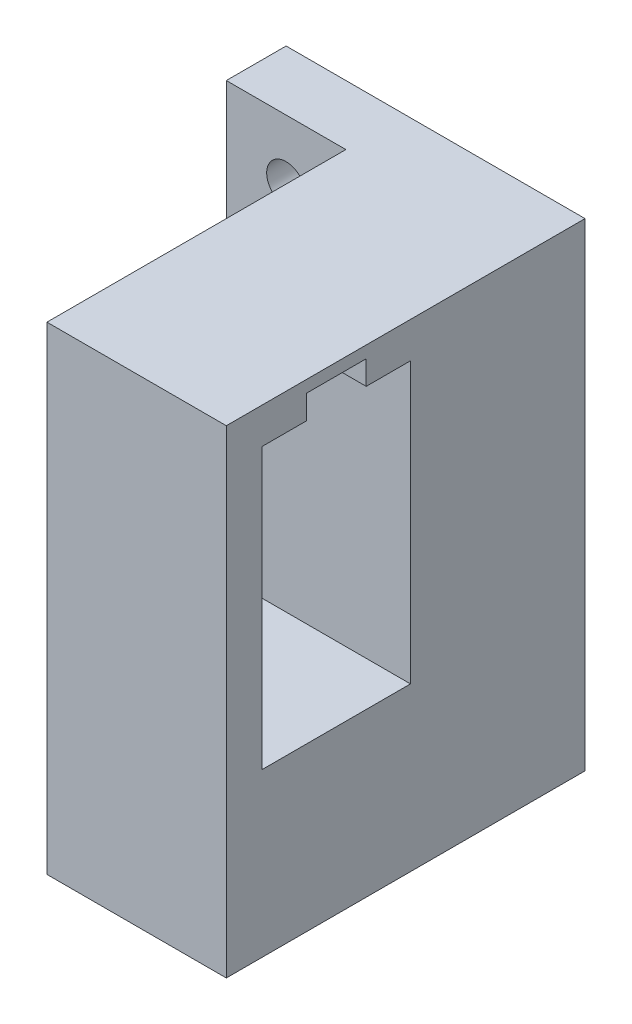
ISO-10303-21;
HEADER;
FILE_DESCRIPTION(('STEP AP214'),'2;1');
FILE_NAME('part.step','',(''),(''),'','','');
FILE_SCHEMA(('AUTOMOTIVE_DESIGN { 1 0 10303 214 1 1 1 1 }'));
ENDSEC;
DATA;
#1=APPLICATION_CONTEXT('core data for automotive mechanical design processes');
#2=APPLICATION_PROTOCOL_DEFINITION('international standard','automotive_design',2000,#1);
#3=PRODUCT_CONTEXT('',#1,'mechanical');
#4=PRODUCT('Part','Part','',(#3));
#5=PRODUCT_RELATED_PRODUCT_CATEGORY('part','',(#4));
#6=PRODUCT_DEFINITION_FORMATION('','',#4);
#7=PRODUCT_DEFINITION_CONTEXT('part definition',#1,'design');
#8=PRODUCT_DEFINITION('design','',#6,#7);
#9=PRODUCT_DEFINITION_SHAPE('','',#8);
#10=(LENGTH_UNIT() NAMED_UNIT(*) SI_UNIT(.MILLI.,.METRE.));
#11=(NAMED_UNIT(*) PLANE_ANGLE_UNIT() SI_UNIT($,.RADIAN.));
#12=(NAMED_UNIT(*) SI_UNIT($,.STERADIAN.) SOLID_ANGLE_UNIT());
#13=UNCERTAINTY_MEASURE_WITH_UNIT(LENGTH_MEASURE(1.E-05),#10,'distance_accuracy_value','');
#14=(GEOMETRIC_REPRESENTATION_CONTEXT(3) GLOBAL_UNCERTAINTY_ASSIGNED_CONTEXT((#13)) GLOBAL_UNIT_ASSIGNED_CONTEXT((#10,
#11,#12)) REPRESENTATION_CONTEXT('',''));
#15=CARTESIAN_POINT('',(0.,0.,0.));
#16=DIRECTION('',(0.,0.,1.));
#17=DIRECTION('',(1.,0.,0.));
#18=AXIS2_PLACEMENT_3D('',#15,#16,#17);
#19=CARTESIAN_POINT('',(11.,-3.,0.));
#20=DIRECTION('',(0.,1.,0.));
#21=DIRECTION('',(0.,0.,1.));
#22=AXIS2_PLACEMENT_3D('',#19,#20,#21);
#23=PLANE('',#22);
#24=DIRECTION('',(0.,0.,1.));
#25=VECTOR('',#24,1.);
#26=CARTESIAN_POINT('',(11.,-3.,0.));
#27=LINE('',#26,#25);
#28=CARTESIAN_POINT('',(11.,-3.,23.3));
#29=VERTEX_POINT('',#28);
#30=CARTESIAN_POINT('',(11.,-3.,27.));
#31=VERTEX_POINT('',#30);
#32=EDGE_CURVE('E192',#29,#31,#27,.T.);
#33=ORIENTED_EDGE('',*,*,#32,.F.);
#34=DIRECTION('',(1.,0.,0.));
#35=VECTOR('',#34,1.);
#36=CARTESIAN_POINT('',(11.,-3.,23.3));
#37=LINE('',#36,#35);
#38=CARTESIAN_POINT('',(25.,-3.,23.3));
#39=VERTEX_POINT('',#38);
#40=EDGE_CURVE('E181',#29,#39,#37,.T.);
#41=ORIENTED_EDGE('',*,*,#40,.T.);
#42=DIRECTION('',(0.,0.,1.));
#43=VECTOR('',#42,1.);
#44=CARTESIAN_POINT('',(25.,-3.,0.));
#45=LINE('',#44,#43);
#46=CARTESIAN_POINT('',(25.,-3.,27.));
#47=VERTEX_POINT('',#46);
#48=EDGE_CURVE('E187',#39,#47,#45,.T.);
#49=ORIENTED_EDGE('',*,*,#48,.T.);
#50=DIRECTION('',(1.,0.,0.));
#51=VECTOR('',#50,1.);
#52=CARTESIAN_POINT('',(11.,-3.,27.));
#53=LINE('',#52,#51);
#54=EDGE_CURVE('E199',#31,#47,#53,.T.);
#55=ORIENTED_EDGE('',*,*,#54,.F.);
#56=EDGE_LOOP('',(#33,#41,#49,#55));
#57=FACE_BOUND('',#56,.T.);
#58=ADVANCED_FACE('F33',(#57),#23,.F.);
#59=CARTESIAN_POINT('',(0.,0.,5.));
#60=DIRECTION('',(1.,0.,0.));
#61=DIRECTION('',(0.,1.,0.));
#62=AXIS2_PLACEMENT_3D('',#59,#60,#61);
#63=PLANE('',#62);
#64=DIRECTION('',(0.,-1.,0.));
#65=VECTOR('',#64,1.);
#66=CARTESIAN_POINT('',(0.,0.,0.));
#67=LINE('',#66,#65);
#68=CARTESIAN_POINT('',(0.,0.,0.));
#69=VERTEX_POINT('',#68);
#70=CARTESIAN_POINT('',(0.,-40.,0.));
#71=VERTEX_POINT('',#70);
#72=EDGE_CURVE('E242',#69,#71,#67,.T.);
#73=ORIENTED_EDGE('',*,*,#72,.T.);
#74=DIRECTION('',(0.,0.,-1.));
#75=VECTOR('',#74,1.);
#76=CARTESIAN_POINT('',(0.,-40.,5.));
#77=LINE('',#76,#75);
#78=CARTESIAN_POINT('',(0.,-40.,5.));
#79=VERTEX_POINT('',#78);
#80=EDGE_CURVE('E275',#79,#71,#77,.T.);
#81=ORIENTED_EDGE('',*,*,#80,.F.);
#82=DIRECTION('',(0.,-1.,0.));
#83=VECTOR('',#82,1.);
#84=CARTESIAN_POINT('',(0.,0.,5.));
#85=LINE('',#84,#83);
#86=CARTESIAN_POINT('',(0.,0.,5.));
#87=VERTEX_POINT('',#86);
#88=EDGE_CURVE('E251',#87,#79,#85,.T.);
#89=ORIENTED_EDGE('',*,*,#88,.F.);
#90=DIRECTION('',(0.,0.,-1.));
#91=VECTOR('',#90,1.);
#92=CARTESIAN_POINT('',(0.,0.,5.));
#93=LINE('',#92,#91);
#94=EDGE_CURVE('E259',#87,#69,#93,.T.);
#95=ORIENTED_EDGE('',*,*,#94,.T.);
#96=EDGE_LOOP('',(#73,#81,#89,#95));
#97=FACE_BOUND('',#96,.T.);
#98=ADVANCED_FACE('F35',(#97),#63,.F.);
#99=CARTESIAN_POINT('',(0.,-40.,5.));
#100=DIRECTION('',(0.,1.,0.));
#101=DIRECTION('',(0.,0.,1.));
#102=AXIS2_PLACEMENT_3D('',#99,#100,#101);
#103=PLANE('',#102);
#104=DIRECTION('',(1.,0.,0.));
#105=VECTOR('',#104,1.);
#106=CARTESIAN_POINT('',(0.,-40.,0.));
#107=LINE('',#106,#105);
#108=CARTESIAN_POINT('',(25.,-40.,0.));
#109=VERTEX_POINT('',#108);
#110=EDGE_CURVE('E262',#71,#109,#107,.T.);
#111=ORIENTED_EDGE('',*,*,#110,.T.);
#112=DIRECTION('',(0.,0.,-1.));
#113=VECTOR('',#112,1.);
#114=CARTESIAN_POINT('',(25.,-40.,5.));
#115=LINE('',#114,#113);
#116=CARTESIAN_POINT('',(25.,-40.,30.));
#117=VERTEX_POINT('',#116);
#118=EDGE_CURVE('E272',#117,#109,#115,.T.);
#119=ORIENTED_EDGE('',*,*,#118,.F.);
#120=DIRECTION('',(1.,0.,0.));
#121=VECTOR('',#120,1.);
#122=CARTESIAN_POINT('',(25.,-40.,30.));
#123=LINE('',#122,#121);
#124=CARTESIAN_POINT('',(10.,-40.,30.));
#125=VERTEX_POINT('',#124);
#126=EDGE_CURVE('E227',#125,#117,#123,.T.);
#127=ORIENTED_EDGE('',*,*,#126,.F.);
#128=DIRECTION('',(0.,0.,-1.));
#129=VECTOR('',#128,1.);
#130=CARTESIAN_POINT('',(10.,-40.,30.));
#131=LINE('',#130,#129);
#132=CARTESIAN_POINT('',(10.,-40.,5.));
#133=VERTEX_POINT('',#132);
#134=EDGE_CURVE('E230',#125,#133,#131,.T.);
#135=ORIENTED_EDGE('',*,*,#134,.T.);
#136=DIRECTION('',(1.,0.,0.));
#137=VECTOR('',#136,1.);
#138=CARTESIAN_POINT('',(0.,-40.,5.));
#139=LINE('',#138,#137);
#140=EDGE_CURVE('E254',#79,#133,#139,.T.);
#141=ORIENTED_EDGE('',*,*,#140,.F.);
#142=ORIENTED_EDGE('',*,*,#80,.T.);
#143=EDGE_LOOP('',(#111,#119,#127,#135,#141,#142));
#144=FACE_BOUND('',#143,.T.);
#145=ADVANCED_FACE('F327',(#144),#103,.F.);
#146=CARTESIAN_POINT('',(25.,0.,5.));
#147=DIRECTION('',(-1.,0.,0.));
#148=DIRECTION('',(0.,-1.,0.));
#149=AXIS2_PLACEMENT_3D('',#146,#147,#148);
#150=PLANE('',#149);
#151=ORIENTED_EDGE('',*,*,#48,.F.);
#152=DIRECTION('',(0.,-1.,0.));
#153=VECTOR('',#152,1.);
#154=CARTESIAN_POINT('',(25.,-1.,23.3));
#155=LINE('',#154,#153);
#156=CARTESIAN_POINT('',(25.,-1.,23.3));
#157=VERTEX_POINT('',#156);
#158=EDGE_CURVE('E164',#157,#39,#155,.T.);
#159=ORIENTED_EDGE('',*,*,#158,.F.);
#160=DIRECTION('',(0.,0.,1.));
#161=VECTOR('',#160,1.);
#162=CARTESIAN_POINT('',(25.,-1.,23.3));
#163=LINE('',#162,#161);
#164=CARTESIAN_POINT('',(25.,-1.,18.3));
#165=VERTEX_POINT('',#164);
#166=EDGE_CURVE('E150',#165,#157,#163,.T.);
#167=ORIENTED_EDGE('',*,*,#166,.F.);
#168=DIRECTION('',(0.,1.,0.));
#169=VECTOR('',#168,1.);
#170=CARTESIAN_POINT('',(25.,-1.,18.3));
#171=LINE('',#170,#169);
#172=CARTESIAN_POINT('',(25.,-3.,18.3));
#173=VERTEX_POINT('',#172);
#174=EDGE_CURVE('E157',#173,#165,#171,.T.);
#175=ORIENTED_EDGE('',*,*,#174,.F.);
#176=CARTESIAN_POINT('',(25.,-3.,14.6));
#177=VERTEX_POINT('',#176);
#178=EDGE_CURVE('E200',#177,#173,#45,.T.);
#179=ORIENTED_EDGE('',*,*,#178,.F.);
#180=DIRECTION('',(0.,-1.,0.));
#181=VECTOR('',#180,1.);
#182=CARTESIAN_POINT('',(25.,0.,14.6));
#183=LINE('',#182,#181);
#184=CARTESIAN_POINT('',(25.,-26.4,14.6));
#185=VERTEX_POINT('',#184);
#186=EDGE_CURVE('E208',#177,#185,#183,.T.);
#187=ORIENTED_EDGE('',*,*,#186,.T.);
#188=DIRECTION('',(0.,0.,1.));
#189=VECTOR('',#188,1.);
#190=CARTESIAN_POINT('',(25.,-26.4,0.));
#191=LINE('',#190,#189);
#192=CARTESIAN_POINT('',(25.,-26.4,27.));
#193=VERTEX_POINT('',#192);
#194=EDGE_CURVE('E205',#185,#193,#191,.T.);
#195=ORIENTED_EDGE('',*,*,#194,.T.);
#196=DIRECTION('',(0.,-1.,0.));
#197=VECTOR('',#196,1.);
#198=CARTESIAN_POINT('',(25.,0.,27.));
#199=LINE('',#198,#197);
#200=EDGE_CURVE('E202',#47,#193,#199,.T.);
#201=ORIENTED_EDGE('',*,*,#200,.F.);
#202=EDGE_LOOP('',(#151,#159,#167,#175,#179,#187,#195,#201));
#203=FACE_BOUND('',#202,.T.);
#204=DIRECTION('',(0.,1.,0.));
#205=VECTOR('',#204,1.);
#206=CARTESIAN_POINT('',(25.,0.,0.));
#207=LINE('',#206,#205);
#208=CARTESIAN_POINT('',(25.,0.,0.));
#209=VERTEX_POINT('',#208);
#210=EDGE_CURVE('E264',#109,#209,#207,.T.);
#211=ORIENTED_EDGE('',*,*,#210,.T.);
#212=DIRECTION('',(0.,0.,-1.));
#213=VECTOR('',#212,1.);
#214=CARTESIAN_POINT('',(25.,0.,5.));
#215=LINE('',#214,#213);
#216=CARTESIAN_POINT('',(25.,0.,30.));
#217=VERTEX_POINT('',#216);
#218=EDGE_CURVE('E269',#217,#209,#215,.T.);
#219=ORIENTED_EDGE('',*,*,#218,.F.);
#220=DIRECTION('',(0.,1.,0.));
#221=VECTOR('',#220,1.);
#222=CARTESIAN_POINT('',(25.,0.,30.));
#223=LINE('',#222,#221);
#224=EDGE_CURVE('E220',#117,#217,#223,.T.);
#225=ORIENTED_EDGE('',*,*,#224,.F.);
#226=ORIENTED_EDGE('',*,*,#118,.T.);
#227=EDGE_LOOP('',(#211,#219,#225,#226));
#228=FACE_BOUND('',#227,.T.);
#229=ADVANCED_FACE('F167',(#203,#228),#150,.F.);
#230=CARTESIAN_POINT('',(0.,0.,5.));
#231=DIRECTION('',(0.,-1.,0.));
#232=DIRECTION('',(0.,0.,-1.));
#233=AXIS2_PLACEMENT_3D('',#230,#231,#232);
#234=PLANE('',#233);
#235=DIRECTION('',(-1.,0.,0.));
#236=VECTOR('',#235,1.);
#237=CARTESIAN_POINT('',(0.,0.,0.));
#238=LINE('',#237,#236);
#239=EDGE_CURVE('E255',#209,#69,#238,.T.);
#240=ORIENTED_EDGE('',*,*,#239,.T.);
#241=ORIENTED_EDGE('',*,*,#94,.F.);
#242=DIRECTION('',(-1.,0.,0.));
#243=VECTOR('',#242,1.);
#244=CARTESIAN_POINT('',(0.,0.,5.));
#245=LINE('',#244,#243);
#246=CARTESIAN_POINT('',(10.,0.,5.));
#247=VERTEX_POINT('',#246);
#248=EDGE_CURVE('E257',#247,#87,#245,.T.);
#249=ORIENTED_EDGE('',*,*,#248,.F.);
#250=DIRECTION('',(0.,0.,-1.));
#251=VECTOR('',#250,1.);
#252=CARTESIAN_POINT('',(10.,0.,30.));
#253=LINE('',#252,#251);
#254=CARTESIAN_POINT('',(10.,0.,30.));
#255=VERTEX_POINT('',#254);
#256=EDGE_CURVE('E235',#255,#247,#253,.T.);
#257=ORIENTED_EDGE('',*,*,#256,.F.);
#258=DIRECTION('',(-1.,0.,0.));
#259=VECTOR('',#258,1.);
#260=CARTESIAN_POINT('',(25.,0.,30.));
#261=LINE('',#260,#259);
#262=EDGE_CURVE('E223',#217,#255,#261,.T.);
#263=ORIENTED_EDGE('',*,*,#262,.F.);
#264=ORIENTED_EDGE('',*,*,#218,.T.);
#265=EDGE_LOOP('',(#240,#241,#249,#257,#263,#264));
#266=FACE_BOUND('',#265,.T.);
#267=ADVANCED_FACE('F349',(#266),#234,.F.);
#268=CARTESIAN_POINT('',(0.,0.,5.));
#269=DIRECTION('',(0.,0.,1.));
#270=DIRECTION('',(1.,0.,0.));
#271=AXIS2_PLACEMENT_3D('',#268,#269,#270);
#272=PLANE('',#271);
#273=DIRECTION('',(0.,-1.,0.));
#274=VECTOR('',#273,1.);
#275=CARTESIAN_POINT('',(10.,0.,5.));
#276=LINE('',#275,#274);
#277=EDGE_CURVE('E213',#247,#133,#276,.T.);
#278=ORIENTED_EDGE('',*,*,#277,.F.);
#279=ORIENTED_EDGE('',*,*,#248,.T.);
#280=ORIENTED_EDGE('',*,*,#88,.T.);
#281=ORIENTED_EDGE('',*,*,#140,.T.);
#282=EDGE_LOOP('',(#278,#279,#280,#281));
#283=FACE_BOUND('',#282,.T.);
#284=CARTESIAN_POINT('',(5.,-5.,5.));
#285=DIRECTION('',(0.,0.,1.));
#286=DIRECTION('',(1.,0.,0.));
#287=AXIS2_PLACEMENT_3D('',#284,#285,#286);
#288=CIRCLE('',#287,1.625);
#289=CARTESIAN_POINT('',(6.625,-5.,5.));
#290=VERTEX_POINT('',#289);
#291=EDGE_CURVE('E243',#290,#290,#288,.T.);
#292=ORIENTED_EDGE('',*,*,#291,.F.);
#293=EDGE_LOOP('',(#292));
#294=FACE_BOUND('',#293,.T.);
#295=CARTESIAN_POINT('',(4.99999999999999,-35.,5.));
#296=DIRECTION('',(0.,0.,1.));
#297=DIRECTION('',(1.,0.,0.));
#298=AXIS2_PLACEMENT_3D('',#295,#296,#297);
#299=CIRCLE('',#298,1.625);
#300=CARTESIAN_POINT('',(6.625,-35.,5.));
#301=VERTEX_POINT('',#300);
#302=EDGE_CURVE('E238',#301,#301,#299,.T.);
#303=ORIENTED_EDGE('',*,*,#302,.F.);
#304=EDGE_LOOP('',(#303));
#305=FACE_BOUND('',#304,.T.);
#306=ADVANCED_FACE('F344',(#283,#294,#305),#272,.T.);
#307=CARTESIAN_POINT('',(0.,0.,0.));
#308=DIRECTION('',(0.,0.,1.));
#309=DIRECTION('',(1.,0.,0.));
#310=AXIS2_PLACEMENT_3D('',#307,#308,#309);
#311=PLANE('',#310);
#312=CARTESIAN_POINT('',(5.,-5.,0.));
#313=DIRECTION('',(0.,0.,1.));
#314=DIRECTION('',(1.,0.,0.));
#315=AXIS2_PLACEMENT_3D('',#312,#313,#314);
#316=CIRCLE('',#315,1.625);
#317=CARTESIAN_POINT('',(6.625,-5.,0.));
#318=VERTEX_POINT('',#317);
#319=EDGE_CURVE('E239',#318,#318,#316,.T.);
#320=ORIENTED_EDGE('',*,*,#319,.T.);
#321=EDGE_LOOP('',(#320));
#322=FACE_BOUND('',#321,.T.);
#323=CARTESIAN_POINT('',(4.99999999999999,-35.,0.));
#324=DIRECTION('',(0.,0.,1.));
#325=DIRECTION('',(1.,0.,0.));
#326=AXIS2_PLACEMENT_3D('',#323,#324,#325);
#327=CIRCLE('',#326,1.625);
#328=CARTESIAN_POINT('',(6.625,-35.,0.));
#329=VERTEX_POINT('',#328);
#330=EDGE_CURVE('E246',#329,#329,#327,.T.);
#331=ORIENTED_EDGE('',*,*,#330,.T.);
#332=EDGE_LOOP('',(#331));
#333=FACE_BOUND('',#332,.T.);
#334=ORIENTED_EDGE('',*,*,#72,.F.);
#335=ORIENTED_EDGE('',*,*,#239,.F.);
#336=ORIENTED_EDGE('',*,*,#210,.F.);
#337=ORIENTED_EDGE('',*,*,#110,.F.);
#338=EDGE_LOOP('',(#334,#335,#336,#337));
#339=FACE_BOUND('',#338,.T.);
#340=ADVANCED_FACE('F339',(#322,#333,#339),#311,.F.);
#341=CARTESIAN_POINT('',(4.99999999999999,-35.,0.));
#342=DIRECTION('',(0.,0.,1.));
#343=DIRECTION('',(1.,0.,0.));
#344=AXIS2_PLACEMENT_3D('',#341,#342,#343);
#345=CYLINDRICAL_SURFACE('',#344,1.625);
#346=ORIENTED_EDGE('',*,*,#330,.F.);
#347=EDGE_LOOP('',(#346));
#348=FACE_BOUND('',#347,.T.);
#349=ORIENTED_EDGE('',*,*,#302,.T.);
#350=EDGE_LOOP('',(#349));
#351=FACE_BOUND('',#350,.T.);
#352=ADVANCED_FACE('F359',(#348,#351),#345,.F.);
#353=CARTESIAN_POINT('',(5.,-5.,0.));
#354=DIRECTION('',(0.,0.,1.));
#355=DIRECTION('',(1.,0.,0.));
#356=AXIS2_PLACEMENT_3D('',#353,#354,#355);
#357=CYLINDRICAL_SURFACE('',#356,1.625);
#358=ORIENTED_EDGE('',*,*,#319,.F.);
#359=EDGE_LOOP('',(#358));
#360=FACE_BOUND('',#359,.T.);
#361=ORIENTED_EDGE('',*,*,#291,.T.);
#362=EDGE_LOOP('',(#361));
#363=FACE_BOUND('',#362,.T.);
#364=ADVANCED_FACE('F354',(#360,#363),#357,.F.);
#365=CARTESIAN_POINT('',(10.,0.,30.));
#366=DIRECTION('',(1.,0.,0.));
#367=DIRECTION('',(0.,1.,0.));
#368=AXIS2_PLACEMENT_3D('',#365,#366,#367);
#369=PLANE('',#368);
#370=DIRECTION('',(0.,0.,1.));
#371=VECTOR('',#370,1.);
#372=CARTESIAN_POINT('',(10.,-1.,30.));
#373=LINE('',#372,#371);
#374=CARTESIAN_POINT('',(10.,-1.,18.3));
#375=VERTEX_POINT('',#374);
#376=CARTESIAN_POINT('',(10.,-1.,23.3));
#377=VERTEX_POINT('',#376);
#378=EDGE_CURVE('E11',#375,#377,#373,.T.);
#379=ORIENTED_EDGE('',*,*,#378,.T.);
#380=DIRECTION('',(0.,-1.,0.));
#381=VECTOR('',#380,1.);
#382=CARTESIAN_POINT('',(10.,0.,23.3));
#383=LINE('',#382,#381);
#384=CARTESIAN_POINT('',(10.,-5.,23.3));
#385=VERTEX_POINT('',#384);
#386=EDGE_CURVE('E184',#377,#385,#383,.T.);
#387=ORIENTED_EDGE('',*,*,#386,.T.);
#388=DIRECTION('',(0.,0.,-1.));
#389=VECTOR('',#388,1.);
#390=CARTESIAN_POINT('',(10.,-5.,30.));
#391=LINE('',#390,#389);
#392=CARTESIAN_POINT('',(10.,-5.,18.3));
#393=VERTEX_POINT('',#392);
#394=EDGE_CURVE('E173',#385,#393,#391,.T.);
#395=ORIENTED_EDGE('',*,*,#394,.T.);
#396=DIRECTION('',(0.,1.,0.));
#397=VECTOR('',#396,1.);
#398=CARTESIAN_POINT('',(10.,0.,18.3));
#399=LINE('',#398,#397);
#400=EDGE_CURVE('E179',#393,#375,#399,.T.);
#401=ORIENTED_EDGE('',*,*,#400,.T.);
#402=EDGE_LOOP('',(#379,#387,#395,#401));
#403=FACE_BOUND('',#402,.T.);
#404=ORIENTED_EDGE('',*,*,#277,.T.);
#405=ORIENTED_EDGE('',*,*,#134,.F.);
#406=DIRECTION('',(0.,-1.,0.));
#407=VECTOR('',#406,1.);
#408=CARTESIAN_POINT('',(10.,0.,30.));
#409=LINE('',#408,#407);
#410=EDGE_CURVE('E225',#255,#125,#409,.T.);
#411=ORIENTED_EDGE('',*,*,#410,.F.);
#412=ORIENTED_EDGE('',*,*,#256,.T.);
#413=EDGE_LOOP('',(#404,#405,#411,#412));
#414=FACE_BOUND('',#413,.T.);
#415=ADVANCED_FACE('F291',(#403,#414),#369,.F.);
#416=CARTESIAN_POINT('',(0.,0.,30.));
#417=DIRECTION('',(0.,0.,-1.));
#418=DIRECTION('',(-1.,0.,0.));
#419=AXIS2_PLACEMENT_3D('',#416,#417,#418);
#420=PLANE('',#419);
#421=ORIENTED_EDGE('',*,*,#224,.T.);
#422=ORIENTED_EDGE('',*,*,#262,.T.);
#423=ORIENTED_EDGE('',*,*,#410,.T.);
#424=ORIENTED_EDGE('',*,*,#126,.T.);
#425=EDGE_LOOP('',(#421,#422,#423,#424));
#426=FACE_BOUND('',#425,.T.);
#427=ADVANCED_FACE('F313',(#426),#420,.F.);
#428=ORIENTED_EDGE('',*,*,#178,.T.);
#429=DIRECTION('',(-1.,0.,0.));
#430=VECTOR('',#429,1.);
#431=CARTESIAN_POINT('',(11.,-3.,18.3));
#432=LINE('',#431,#430);
#433=CARTESIAN_POINT('',(11.,-3.,18.3));
#434=VERTEX_POINT('',#433);
#435=EDGE_CURVE('E160',#173,#434,#432,.T.);
#436=ORIENTED_EDGE('',*,*,#435,.T.);
#437=CARTESIAN_POINT('',(11.,-3.,14.6));
#438=VERTEX_POINT('',#437);
#439=EDGE_CURVE('E188',#438,#434,#27,.T.);
#440=ORIENTED_EDGE('',*,*,#439,.F.);
#441=DIRECTION('',(1.,0.,0.));
#442=VECTOR('',#441,1.);
#443=CARTESIAN_POINT('',(11.,-3.,14.6));
#444=LINE('',#443,#442);
#445=EDGE_CURVE('E211',#438,#177,#444,.T.);
#446=ORIENTED_EDGE('',*,*,#445,.T.);
#447=EDGE_LOOP('',(#428,#436,#440,#446));
#448=FACE_BOUND('',#447,.T.);
#449=ADVANCED_FACE('F311',(#448),#23,.F.);
#450=CARTESIAN_POINT('',(11.,0.,14.6));
#451=DIRECTION('',(0.,0.,1.));
#452=DIRECTION('',(0.,-1.,0.));
#453=AXIS2_PLACEMENT_3D('',#450,#451,#452);
#454=PLANE('',#453);
#455=ORIENTED_EDGE('',*,*,#186,.F.);
#456=ORIENTED_EDGE('',*,*,#445,.F.);
#457=DIRECTION('',(0.,-1.,0.));
#458=VECTOR('',#457,1.);
#459=CARTESIAN_POINT('',(11.,0.,14.6));
#460=LINE('',#459,#458);
#461=CARTESIAN_POINT('',(11.,-26.4,14.6));
#462=VERTEX_POINT('',#461);
#463=EDGE_CURVE('E197',#438,#462,#460,.T.);
#464=ORIENTED_EDGE('',*,*,#463,.T.);
#465=DIRECTION('',(1.,0.,0.));
#466=VECTOR('',#465,1.);
#467=CARTESIAN_POINT('',(11.,-26.4,14.6));
#468=LINE('',#467,#466);
#469=EDGE_CURVE('E214',#462,#185,#468,.T.);
#470=ORIENTED_EDGE('',*,*,#469,.T.);
#471=EDGE_LOOP('',(#455,#456,#464,#470));
#472=FACE_BOUND('',#471,.T.);
#473=ADVANCED_FACE('F309',(#472),#454,.T.);
#474=CARTESIAN_POINT('',(11.,-26.4,0.));
#475=DIRECTION('',(0.,1.,0.));
#476=DIRECTION('',(0.,0.,1.));
#477=AXIS2_PLACEMENT_3D('',#474,#475,#476);
#478=PLANE('',#477);
#479=ORIENTED_EDGE('',*,*,#194,.F.);
#480=ORIENTED_EDGE('',*,*,#469,.F.);
#481=DIRECTION('',(0.,0.,1.));
#482=VECTOR('',#481,1.);
#483=CARTESIAN_POINT('',(11.,-26.4,0.));
#484=LINE('',#483,#482);
#485=CARTESIAN_POINT('',(11.,-26.4,27.));
#486=VERTEX_POINT('',#485);
#487=EDGE_CURVE('E195',#462,#486,#484,.T.);
#488=ORIENTED_EDGE('',*,*,#487,.T.);
#489=DIRECTION('',(1.,0.,0.));
#490=VECTOR('',#489,1.);
#491=CARTESIAN_POINT('',(11.,-26.4,27.));
#492=LINE('',#491,#490);
#493=EDGE_CURVE('E216',#486,#193,#492,.T.);
#494=ORIENTED_EDGE('',*,*,#493,.T.);
#495=EDGE_LOOP('',(#479,#480,#488,#494));
#496=FACE_BOUND('',#495,.T.);
#497=ADVANCED_FACE('F306',(#496),#478,.T.);
#498=CARTESIAN_POINT('',(11.,0.,27.));
#499=DIRECTION('',(0.,0.,1.));
#500=DIRECTION('',(0.,-1.,0.));
#501=AXIS2_PLACEMENT_3D('',#498,#499,#500);
#502=PLANE('',#501);
#503=ORIENTED_EDGE('',*,*,#200,.T.);
#504=ORIENTED_EDGE('',*,*,#493,.F.);
#505=DIRECTION('',(0.,-1.,0.));
#506=VECTOR('',#505,1.);
#507=CARTESIAN_POINT('',(11.,0.,27.));
#508=LINE('',#507,#506);
#509=EDGE_CURVE('E191',#31,#486,#508,.T.);
#510=ORIENTED_EDGE('',*,*,#509,.F.);
#511=ORIENTED_EDGE('',*,*,#54,.T.);
#512=EDGE_LOOP('',(#503,#504,#510,#511));
#513=FACE_BOUND('',#512,.T.);
#514=ADVANCED_FACE('F299',(#513),#502,.F.);
#515=CARTESIAN_POINT('',(11.,0.,0.));
#516=DIRECTION('',(1.,0.,0.));
#517=DIRECTION('',(0.,1.,0.));
#518=AXIS2_PLACEMENT_3D('',#515,#516,#517);
#519=PLANE('',#518);
#520=DIRECTION('',(0.,-1.,0.));
#521=VECTOR('',#520,1.);
#522=CARTESIAN_POINT('',(11.,0.,23.3));
#523=LINE('',#522,#521);
#524=CARTESIAN_POINT('',(11.,-5.,23.3));
#525=VERTEX_POINT('',#524);
#526=EDGE_CURVE('E41',#29,#525,#523,.T.);
#527=ORIENTED_EDGE('',*,*,#526,.F.);
#528=ORIENTED_EDGE('',*,*,#32,.T.);
#529=ORIENTED_EDGE('',*,*,#509,.T.);
#530=ORIENTED_EDGE('',*,*,#487,.F.);
#531=ORIENTED_EDGE('',*,*,#463,.F.);
#532=ORIENTED_EDGE('',*,*,#439,.T.);
#533=DIRECTION('',(0.,1.,0.));
#534=VECTOR('',#533,1.);
#535=CARTESIAN_POINT('',(11.,0.,18.3));
#536=LINE('',#535,#534);
#537=CARTESIAN_POINT('',(11.,-5.,18.3));
#538=VERTEX_POINT('',#537);
#539=EDGE_CURVE('E280',#538,#434,#536,.T.);
#540=ORIENTED_EDGE('',*,*,#539,.F.);
#541=DIRECTION('',(0.,0.,-1.));
#542=VECTOR('',#541,1.);
#543=CARTESIAN_POINT('',(11.,-5.,0.));
#544=LINE('',#543,#542);
#545=EDGE_CURVE('E278',#525,#538,#544,.T.);
#546=ORIENTED_EDGE('',*,*,#545,.F.);
#547=EDGE_LOOP('',(#527,#528,#529,#530,#531,#532,#540,#546));
#548=FACE_BOUND('',#547,.T.);
#549=ADVANCED_FACE('F288',(#548),#519,.T.);
#550=CARTESIAN_POINT('',(0.,-1.,23.3));
#551=DIRECTION('',(0.,1.,0.));
#552=DIRECTION('',(-1.,0.,0.));
#553=AXIS2_PLACEMENT_3D('',#550,#551,#552);
#554=PLANE('',#553);
#555=DIRECTION('',(1.,0.,0.));
#556=VECTOR('',#555,1.);
#557=CARTESIAN_POINT('',(0.,-1.,18.3));
#558=LINE('',#557,#556);
#559=EDGE_CURVE('E145',#375,#165,#558,.T.);
#560=ORIENTED_EDGE('',*,*,#559,.T.);
#561=ORIENTED_EDGE('',*,*,#166,.T.);
#562=DIRECTION('',(1.,0.,0.));
#563=VECTOR('',#562,1.);
#564=CARTESIAN_POINT('',(0.,-1.,23.3));
#565=LINE('',#564,#563);
#566=EDGE_CURVE('E154',#377,#157,#565,.T.);
#567=ORIENTED_EDGE('',*,*,#566,.F.);
#568=ORIENTED_EDGE('',*,*,#378,.F.);
#569=EDGE_LOOP('',(#560,#561,#567,#568));
#570=FACE_BOUND('',#569,.T.);
#571=ADVANCED_FACE('F147',(#570),#554,.F.);
#572=CARTESIAN_POINT('',(0.,-1.,23.3));
#573=DIRECTION('',(0.,0.,1.));
#574=DIRECTION('',(1.,0.,0.));
#575=AXIS2_PLACEMENT_3D('',#572,#573,#574);
#576=PLANE('',#575);
#577=ORIENTED_EDGE('',*,*,#566,.T.);
#578=ORIENTED_EDGE('',*,*,#158,.T.);
#579=ORIENTED_EDGE('',*,*,#40,.F.);
#580=ORIENTED_EDGE('',*,*,#526,.T.);
#581=DIRECTION('',(1.,0.,0.));
#582=VECTOR('',#581,1.);
#583=CARTESIAN_POINT('',(0.,-5.,23.3));
#584=LINE('',#583,#582);
#585=EDGE_CURVE('E53',#385,#525,#584,.T.);
#586=ORIENTED_EDGE('',*,*,#585,.F.);
#587=ORIENTED_EDGE('',*,*,#386,.F.);
#588=EDGE_LOOP('',(#577,#578,#579,#580,#586,#587));
#589=FACE_BOUND('',#588,.T.);
#590=ADVANCED_FACE('F284',(#589),#576,.F.);
#591=CARTESIAN_POINT('',(0.,-1.,18.3));
#592=DIRECTION('',(0.,0.,-1.));
#593=DIRECTION('',(-1.,0.,0.));
#594=AXIS2_PLACEMENT_3D('',#591,#592,#593);
#595=PLANE('',#594);
#596=DIRECTION('',(1.,0.,0.));
#597=VECTOR('',#596,1.);
#598=CARTESIAN_POINT('',(0.,-5.,18.3));
#599=LINE('',#598,#597);
#600=EDGE_CURVE('E48',#393,#538,#599,.T.);
#601=ORIENTED_EDGE('',*,*,#600,.T.);
#602=ORIENTED_EDGE('',*,*,#539,.T.);
#603=ORIENTED_EDGE('',*,*,#435,.F.);
#604=ORIENTED_EDGE('',*,*,#174,.T.);
#605=ORIENTED_EDGE('',*,*,#559,.F.);
#606=ORIENTED_EDGE('',*,*,#400,.F.);
#607=EDGE_LOOP('',(#601,#602,#603,#604,#605,#606));
#608=FACE_BOUND('',#607,.T.);
#609=ADVANCED_FACE('F158',(#608),#595,.F.);
#610=CARTESIAN_POINT('',(0.,-5.,23.3));
#611=DIRECTION('',(0.,-1.,0.));
#612=DIRECTION('',(1.,0.,0.));
#613=AXIS2_PLACEMENT_3D('',#610,#611,#612);
#614=PLANE('',#613);
#615=ORIENTED_EDGE('',*,*,#585,.T.);
#616=ORIENTED_EDGE('',*,*,#545,.T.);
#617=ORIENTED_EDGE('',*,*,#600,.F.);
#618=ORIENTED_EDGE('',*,*,#394,.F.);
#619=EDGE_LOOP('',(#615,#616,#617,#618));
#620=FACE_BOUND('',#619,.T.);
#621=ADVANCED_FACE('F289',(#620),#614,.F.);
#622=CLOSED_SHELL('',(#58,#98,#145,#229,#267,#306,#340,#352,#364,#415,#427,#449,#473,#497,#514,
#549,#571,#590,#609,#621));
#623=MANIFOLD_SOLID_BREP('B2',#622);
#624=ADVANCED_BREP_SHAPE_REPRESENTATION('',(#18,#623),#14);
#625=SHAPE_DEFINITION_REPRESENTATION(#9,#624);
ENDSEC;
END-ISO-10303-21;
